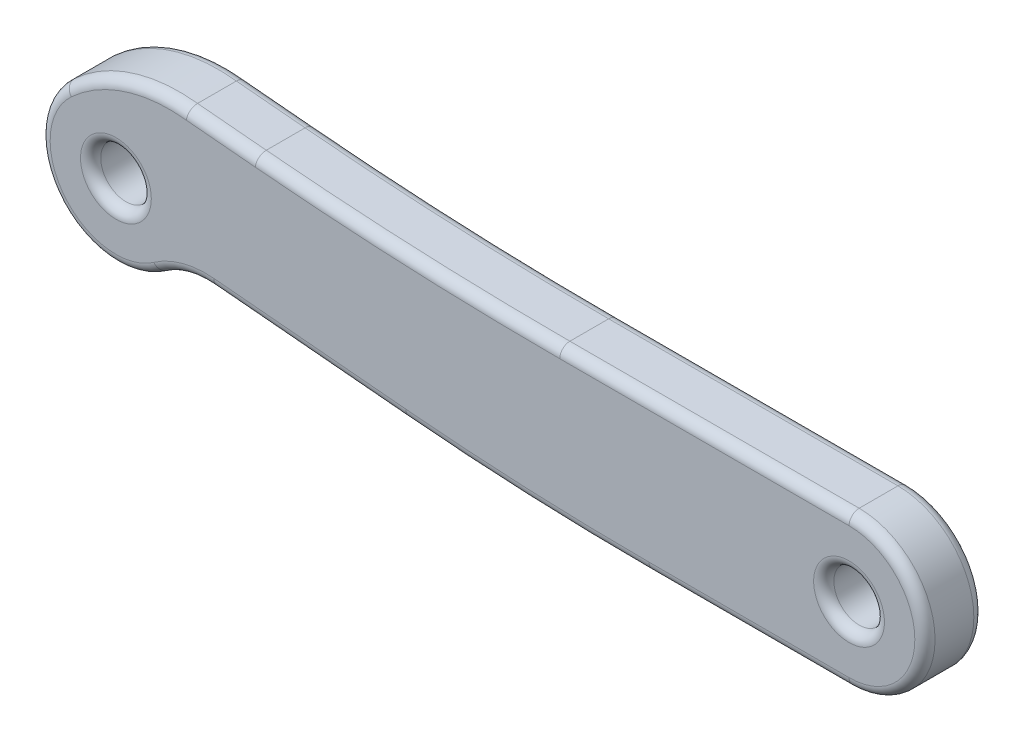
ISO-10303-21;
HEADER;
FILE_DESCRIPTION(('STEP AP214'),'2;1');
FILE_NAME('part.step','',(''),(''),'','','');
FILE_SCHEMA(('AUTOMOTIVE_DESIGN { 1 0 10303 214 1 1 1 1 }'));
ENDSEC;
DATA;
#1=APPLICATION_CONTEXT('core data for automotive mechanical design processes');
#2=APPLICATION_PROTOCOL_DEFINITION('international standard','automotive_design',2000,#1);
#3=PRODUCT_CONTEXT('',#1,'mechanical');
#4=PRODUCT('Part','Part','',(#3));
#5=PRODUCT_RELATED_PRODUCT_CATEGORY('part','',(#4));
#6=PRODUCT_DEFINITION_FORMATION('','',#4);
#7=PRODUCT_DEFINITION_CONTEXT('part definition',#1,'design');
#8=PRODUCT_DEFINITION('design','',#6,#7);
#9=PRODUCT_DEFINITION_SHAPE('','',#8);
#10=(LENGTH_UNIT() NAMED_UNIT(*) SI_UNIT(.MILLI.,.METRE.));
#11=(NAMED_UNIT(*) PLANE_ANGLE_UNIT() SI_UNIT($,.RADIAN.));
#12=(NAMED_UNIT(*) SI_UNIT($,.STERADIAN.) SOLID_ANGLE_UNIT());
#13=UNCERTAINTY_MEASURE_WITH_UNIT(LENGTH_MEASURE(1.E-05),#10,'distance_accuracy_value','');
#14=(GEOMETRIC_REPRESENTATION_CONTEXT(3) GLOBAL_UNCERTAINTY_ASSIGNED_CONTEXT((#13)) GLOBAL_UNIT_ASSIGNED_CONTEXT((#10,
#11,#12)) REPRESENTATION_CONTEXT('',''));
#15=CARTESIAN_POINT('',(0.,0.,0.));
#16=DIRECTION('',(0.,0.,1.));
#17=DIRECTION('',(1.,0.,0.));
#18=AXIS2_PLACEMENT_3D('',#15,#16,#17);
#19=CARTESIAN_POINT('',(0.,0.,1.75));
#20=DIRECTION('',(0.,0.,-1.));
#21=DIRECTION('',(-1.,0.,0.));
#22=AXIS2_PLACEMENT_3D('',#19,#20,#21);
#23=CYLINDRICAL_SURFACE('',#22,2.25);
#24=DIRECTION('',(0.,0.,1.));
#25=VECTOR('',#24,1.);
#26=CARTESIAN_POINT('',(-1.52467335470079,1.65465137157816,0.));
#27=LINE('',#26,#25);
#28=CARTESIAN_POINT('',(-1.52467335470079,1.65465137157816,0.3));
#29=VERTEX_POINT('',#28);
#30=CARTESIAN_POINT('',(-1.52467335470079,1.65465137157816,1.45));
#31=VERTEX_POINT('',#30);
#32=EDGE_CURVE('E458',#29,#31,#27,.T.);
#33=ORIENTED_EDGE('',*,*,#32,.F.);
#34=CARTESIAN_POINT('',(0.,0.,0.3));
#35=DIRECTION('',(0.,0.,1.));
#36=DIRECTION('',(1.,0.,0.));
#37=AXIS2_PLACEMENT_3D('',#34,#35,#36);
#38=CIRCLE('',#37,2.25);
#39=CARTESIAN_POINT('',(1.29610472523494,-1.83918801138537,0.3));
#40=VERTEX_POINT('',#39);
#41=EDGE_CURVE('E261',#29,#40,#38,.T.);
#42=ORIENTED_EDGE('',*,*,#41,.T.);
#43=DIRECTION('',(0.,0.,1.));
#44=VECTOR('',#43,1.);
#45=CARTESIAN_POINT('',(1.29610472523494,-1.83918801138537,0.));
#46=LINE('',#45,#44);
#47=CARTESIAN_POINT('',(1.29610472523494,-1.83918801138537,1.45));
#48=VERTEX_POINT('',#47);
#49=EDGE_CURVE('E405',#40,#48,#46,.T.);
#50=ORIENTED_EDGE('',*,*,#49,.T.);
#51=CARTESIAN_POINT('',(0.,0.,1.45));
#52=DIRECTION('',(0.,0.,1.));
#53=DIRECTION('',(1.,0.,0.));
#54=AXIS2_PLACEMENT_3D('',#51,#52,#53);
#55=CIRCLE('',#54,2.25);
#56=EDGE_CURVE('E259',#48,#31,#55,.F.);
#57=ORIENTED_EDGE('',*,*,#56,.T.);
#58=EDGE_LOOP('',(#33,#42,#50,#57));
#59=FACE_BOUND('',#58,.T.);
#60=ADVANCED_FACE('F34',(#59),#23,.T.);
#61=CARTESIAN_POINT('',(0.,2.25,1.75));
#62=DIRECTION('',(0.,-1.,0.));
#63=DIRECTION('',(0.,0.,-1.));
#64=AXIS2_PLACEMENT_3D('',#61,#62,#63);
#65=PLANE('',#64);
#66=DIRECTION('',(0.,0.,-1.));
#67=VECTOR('',#66,1.);
#68=CARTESIAN_POINT('',(21.74082228,2.25,1.75));
#69=LINE('',#68,#67);
#70=CARTESIAN_POINT('',(21.74082228,2.25,1.45));
#71=VERTEX_POINT('',#70);
#72=CARTESIAN_POINT('',(21.74082228,2.25,0.3));
#73=VERTEX_POINT('',#72);
#74=EDGE_CURVE('E403',#71,#73,#69,.T.);
#75=ORIENTED_EDGE('',*,*,#74,.T.);
#76=DIRECTION('',(-1.,0.,0.));
#77=VECTOR('',#76,1.);
#78=CARTESIAN_POINT('',(0.,2.25,0.3));
#79=LINE('',#78,#77);
#80=CARTESIAN_POINT('',(13.162158488708,2.25,0.3));
#81=VERTEX_POINT('',#80);
#82=EDGE_CURVE('E244',#73,#81,#79,.T.);
#83=ORIENTED_EDGE('',*,*,#82,.T.);
#84=DIRECTION('',(0.,0.,1.));
#85=VECTOR('',#84,1.);
#86=CARTESIAN_POINT('',(13.162158488708,2.25,0.));
#87=LINE('',#86,#85);
#88=CARTESIAN_POINT('',(13.162158488708,2.25,1.45));
#89=VERTEX_POINT('',#88);
#90=EDGE_CURVE('E475',#81,#89,#87,.T.);
#91=ORIENTED_EDGE('',*,*,#90,.T.);
#92=DIRECTION('',(-1.,0.,0.));
#93=VECTOR('',#92,1.);
#94=CARTESIAN_POINT('',(21.74082228,2.25,1.45));
#95=LINE('',#94,#93);
#96=EDGE_CURVE('E242',#89,#71,#95,.F.);
#97=ORIENTED_EDGE('',*,*,#96,.T.);
#98=EDGE_LOOP('',(#75,#83,#91,#97));
#99=FACE_BOUND('',#98,.T.);
#100=ADVANCED_FACE('F479',(#99),#65,.F.);
#101=CARTESIAN_POINT('',(0.,-2.25,1.75));
#102=DIRECTION('',(0.,1.,0.));
#103=DIRECTION('',(0.,0.,1.));
#104=AXIS2_PLACEMENT_3D('',#101,#102,#103);
#105=PLANE('',#104);
#106=DIRECTION('',(0.,0.,1.));
#107=VECTOR('',#106,1.);
#108=CARTESIAN_POINT('',(15.8071767602875,-2.25000000000006,0.));
#109=LINE('',#108,#107);
#110=CARTESIAN_POINT('',(15.8071767602875,-2.25000000000006,0.3));
#111=VERTEX_POINT('',#110);
#112=CARTESIAN_POINT('',(15.8071767602875,-2.25000000000006,1.45));
#113=VERTEX_POINT('',#112);
#114=EDGE_CURVE('E395',#111,#113,#109,.T.);
#115=ORIENTED_EDGE('',*,*,#114,.F.);
#116=DIRECTION('',(1.,0.,0.));
#117=VECTOR('',#116,1.);
#118=CARTESIAN_POINT('',(0.,-2.25,0.3));
#119=LINE('',#118,#117);
#120=CARTESIAN_POINT('',(21.74082228,-2.25,0.3));
#121=VERTEX_POINT('',#120);
#122=EDGE_CURVE('E236',#111,#121,#119,.T.);
#123=ORIENTED_EDGE('',*,*,#122,.T.);
#124=DIRECTION('',(0.,0.,-1.));
#125=VECTOR('',#124,1.);
#126=CARTESIAN_POINT('',(21.74082228,-2.25,1.75));
#127=LINE('',#126,#125);
#128=CARTESIAN_POINT('',(21.74082228,-2.25,1.45));
#129=VERTEX_POINT('',#128);
#130=EDGE_CURVE('E195',#129,#121,#127,.T.);
#131=ORIENTED_EDGE('',*,*,#130,.F.);
#132=DIRECTION('',(1.,0.,0.));
#133=VECTOR('',#132,1.);
#134=CARTESIAN_POINT('',(15.8071767602875,-2.25,1.45));
#135=LINE('',#134,#133);
#136=EDGE_CURVE('E234',#129,#113,#135,.F.);
#137=ORIENTED_EDGE('',*,*,#136,.T.);
#138=EDGE_LOOP('',(#115,#123,#131,#137));
#139=FACE_BOUND('',#138,.T.);
#140=ADVANCED_FACE('F495',(#139),#105,.F.);
#141=CARTESIAN_POINT('',(0.,0.,1.75));
#142=DIRECTION('',(0.,0.,1.));
#143=DIRECTION('',(1.,0.,0.));
#144=AXIS2_PLACEMENT_3D('',#141,#142,#143);
#145=PLANE('',#144);
#146=CARTESIAN_POINT('',(21.74082228,0.,1.75));
#147=DIRECTION('',(0.,0.,1.));
#148=DIRECTION('',(1.,0.,0.));
#149=AXIS2_PLACEMENT_3D('',#146,#147,#148);
#150=CIRCLE('',#149,1.05);
#151=CARTESIAN_POINT('',(22.79082228,0.,1.75));
#152=VERTEX_POINT('',#151);
#153=EDGE_CURVE('E12',#152,#152,#150,.F.);
#154=ORIENTED_EDGE('',*,*,#153,.T.);
#155=EDGE_LOOP('',(#154));
#156=FACE_BOUND('',#155,.T.);
#157=CARTESIAN_POINT('',(0.,0.,1.75));
#158=DIRECTION('',(0.,0.,1.));
#159=DIRECTION('',(1.,0.,0.));
#160=AXIS2_PLACEMENT_3D('',#157,#158,#159);
#161=CIRCLE('',#160,1.05);
#162=CARTESIAN_POINT('',(1.05,0.,1.75));
#163=VERTEX_POINT('',#162);
#164=EDGE_CURVE('E43',#163,#163,#161,.F.);
#165=ORIENTED_EDGE('',*,*,#164,.T.);
#166=EDGE_LOOP('',(#165));
#167=FACE_BOUND('',#166,.T.);
#168=CARTESIAN_POINT('',(13.162158488708,102.934591607014,1.75));
#169=DIRECTION('',(0.,0.,1.));
#170=DIRECTION('',(1.,0.,0.));
#171=AXIS2_PLACEMENT_3D('',#168,#169,#170);
#172=CIRCLE('',#171,100.984591607014);
#173=CARTESIAN_POINT('',(13.162158488708,1.95,1.75));
#174=VERTEX_POINT('',#173);
#175=CARTESIAN_POINT('',(4.1328255389998,2.35447981288885,1.75));
#176=VERTEX_POINT('',#175);
#177=EDGE_CURVE('E51',#174,#176,#172,.F.);
#178=ORIENTED_EDGE('',*,*,#177,.T.);
#179=DIRECTION('',(-0.995994638325983,0.0894129768316409,0.));
#180=VECTOR('',#179,1.);
#181=CARTESIAN_POINT('',(0.242718455459598,2.70370463915676,1.75));
#182=LINE('',#181,#180);
#183=CARTESIAN_POINT('',(2.09015922776099,2.53785517309011,1.75));
#184=VERTEX_POINT('',#183);
#185=EDGE_CURVE('E279',#176,#184,#182,.T.);
#186=ORIENTED_EDGE('',*,*,#185,.T.);
#187=CARTESIAN_POINT('',(1.58269722959737,-1.71762176709653,1.75));
#188=DIRECTION('',(0.,0.,1.));
#189=DIRECTION('',(1.,0.,0.));
#190=AXIS2_PLACEMENT_3D('',#187,#188,#189);
#191=CIRCLE('',#190,4.28562733657985);
#192=CARTESIAN_POINT('',(-1.32138357407402,1.43403118870108,1.75));
#193=VERTEX_POINT('',#192);
#194=EDGE_CURVE('E263',#184,#193,#191,.T.);
#195=ORIENTED_EDGE('',*,*,#194,.T.);
#196=CARTESIAN_POINT('',(0.,0.,1.75));
#197=DIRECTION('',(0.,0.,1.));
#198=DIRECTION('',(1.,0.,0.));
#199=AXIS2_PLACEMENT_3D('',#196,#197,#198);
#200=CIRCLE('',#199,1.95);
#201=CARTESIAN_POINT('',(1.12329076187028,-1.59396294320065,1.75));
#202=VERTEX_POINT('',#201);
#203=EDGE_CURVE('E265',#193,#202,#200,.T.);
#204=ORIENTED_EDGE('',*,*,#203,.T.);
#205=CARTESIAN_POINT('',(2.66557638606268,-3.78248457646024,1.75));
#206=DIRECTION('',(0.,0.,1.));
#207=DIRECTION('',(1.,0.,0.));
#208=AXIS2_PLACEMENT_3D('',#205,#206,#207);
#209=CIRCLE('',#208,2.67736286032277);
#210=CARTESIAN_POINT('',(2.90496736946259,-1.11584552272564,1.75));
#211=VERTEX_POINT('',#210);
#212=EDGE_CURVE('E267',#202,#211,#209,.F.);
#213=ORIENTED_EDGE('',*,*,#212,.T.);
#214=DIRECTION('',(0.995994638325983,-0.0894129768316325,0.));
#215=VECTOR('',#214,1.);
#216=CARTESIAN_POINT('',(-0.0761471648852078,-0.848223274035544,1.75));
#217=LINE('',#216,#215);
#218=CARTESIAN_POINT('',(8.60095043109571,-1.62718843756218,1.75));
#219=VERTEX_POINT('',#218);
#220=EDGE_CURVE('E269',#211,#219,#217,.T.);
#221=ORIENTED_EDGE('',*,*,#220,.T.);
#222=CARTESIAN_POINT('',(15.8071767602885,78.6448597680787,1.75));
#223=DIRECTION('',(0.,0.,1.));
#224=DIRECTION('',(1.,0.,0.));
#225=AXIS2_PLACEMENT_3D('',#222,#223,#224);
#226=CIRCLE('',#225,80.5948597680787);
#227=CARTESIAN_POINT('',(15.8071767602875,-1.95000000000006,1.75));
#228=VERTEX_POINT('',#227);
#229=EDGE_CURVE('E271',#219,#228,#226,.T.);
#230=ORIENTED_EDGE('',*,*,#229,.T.);
#231=DIRECTION('',(1.,0.,0.));
#232=VECTOR('',#231,1.);
#233=CARTESIAN_POINT('',(21.74082228,-1.95,1.75));
#234=LINE('',#233,#232);
#235=CARTESIAN_POINT('',(21.74082228,-1.95,1.75));
#236=VERTEX_POINT('',#235);
#237=EDGE_CURVE('E273',#228,#236,#234,.T.);
#238=ORIENTED_EDGE('',*,*,#237,.T.);
#239=CARTESIAN_POINT('',(21.74082228,0.,1.75));
#240=DIRECTION('',(0.,0.,1.));
#241=DIRECTION('',(1.,0.,0.));
#242=AXIS2_PLACEMENT_3D('',#239,#240,#241);
#243=CIRCLE('',#242,1.95);
#244=CARTESIAN_POINT('',(21.74082228,1.95,1.75));
#245=VERTEX_POINT('',#244);
#246=EDGE_CURVE('E275',#236,#245,#243,.T.);
#247=ORIENTED_EDGE('',*,*,#246,.T.);
#248=DIRECTION('',(-1.,0.,0.));
#249=VECTOR('',#248,1.);
#250=CARTESIAN_POINT('',(13.162158488708,1.95,1.75));
#251=LINE('',#250,#249);
#252=EDGE_CURVE('E56',#245,#174,#251,.T.);
#253=ORIENTED_EDGE('',*,*,#252,.T.);
#254=EDGE_LOOP('',(#178,#186,#195,#204,#213,#221,#230,#238,#247,#253));
#255=FACE_BOUND('',#254,.T.);
#256=ADVANCED_FACE('F719',(#156,#167,#255),#145,.T.);
#257=CARTESIAN_POINT('',(0.,0.,0.));
#258=DIRECTION('',(0.,0.,1.));
#259=DIRECTION('',(1.,0.,0.));
#260=AXIS2_PLACEMENT_3D('',#257,#258,#259);
#261=PLANE('',#260);
#262=CARTESIAN_POINT('',(21.74082228,0.,0.));
#263=DIRECTION('',(0.,0.,1.));
#264=DIRECTION('',(1.,0.,0.));
#265=AXIS2_PLACEMENT_3D('',#262,#263,#264);
#266=CIRCLE('',#265,1.05);
#267=CARTESIAN_POINT('',(22.79082228,0.,0.));
#268=VERTEX_POINT('',#267);
#269=EDGE_CURVE('E203',#268,#268,#266,.T.);
#270=ORIENTED_EDGE('',*,*,#269,.T.);
#271=EDGE_LOOP('',(#270));
#272=FACE_BOUND('',#271,.T.);
#273=CARTESIAN_POINT('',(0.,0.,0.));
#274=DIRECTION('',(0.,0.,1.));
#275=DIRECTION('',(1.,0.,0.));
#276=AXIS2_PLACEMENT_3D('',#273,#274,#275);
#277=CIRCLE('',#276,1.05);
#278=CARTESIAN_POINT('',(1.05,0.,0.));
#279=VERTEX_POINT('',#278);
#280=EDGE_CURVE('E200',#279,#279,#277,.T.);
#281=ORIENTED_EDGE('',*,*,#280,.T.);
#282=EDGE_LOOP('',(#281));
#283=FACE_BOUND('',#282,.T.);
#284=DIRECTION('',(0.995994638325983,-0.0894129768316325,0.));
#285=VECTOR('',#284,1.);
#286=CARTESIAN_POINT('',(2.90496736946259,-1.11584552272564,0.));
#287=LINE('',#286,#285);
#288=CARTESIAN_POINT('',(8.60095043109571,-1.62718843756216,0.));
#289=VERTEX_POINT('',#288);
#290=CARTESIAN_POINT('',(2.90496736946259,-1.11584552272564,0.));
#291=VERTEX_POINT('',#290);
#292=EDGE_CURVE('E199',#289,#291,#287,.F.);
#293=ORIENTED_EDGE('',*,*,#292,.T.);
#294=CARTESIAN_POINT('',(2.66557638606268,-3.78248457646024,0.));
#295=DIRECTION('',(0.,0.,1.));
#296=DIRECTION('',(1.,0.,0.));
#297=AXIS2_PLACEMENT_3D('',#294,#295,#296);
#298=CIRCLE('',#297,2.67736286032277);
#299=CARTESIAN_POINT('',(1.12329076187028,-1.59396294320065,0.));
#300=VERTEX_POINT('',#299);
#301=EDGE_CURVE('E178',#291,#300,#298,.T.);
#302=ORIENTED_EDGE('',*,*,#301,.T.);
#303=CARTESIAN_POINT('',(0.,0.,0.));
#304=DIRECTION('',(0.,0.,1.));
#305=DIRECTION('',(1.,0.,0.));
#306=AXIS2_PLACEMENT_3D('',#303,#304,#305);
#307=CIRCLE('',#306,1.95);
#308=CARTESIAN_POINT('',(-1.32138357407401,1.43403118870107,0.));
#309=VERTEX_POINT('',#308);
#310=EDGE_CURVE('E188',#300,#309,#307,.F.);
#311=ORIENTED_EDGE('',*,*,#310,.T.);
#312=CARTESIAN_POINT('',(1.58269722959737,-1.71762176709653,0.));
#313=DIRECTION('',(0.,0.,1.));
#314=DIRECTION('',(1.,0.,0.));
#315=AXIS2_PLACEMENT_3D('',#312,#313,#314);
#316=CIRCLE('',#315,4.28562733657985);
#317=CARTESIAN_POINT('',(2.090159227761,2.53785517309011,0.));
#318=VERTEX_POINT('',#317);
#319=EDGE_CURVE('E194',#309,#318,#316,.F.);
#320=ORIENTED_EDGE('',*,*,#319,.T.);
#321=DIRECTION('',(-0.995994638325983,0.0894129768316409,0.));
#322=VECTOR('',#321,1.);
#323=CARTESIAN_POINT('',(4.13282553899979,2.35447981288883,0.));
#324=LINE('',#323,#322);
#325=CARTESIAN_POINT('',(4.1328255389998,2.35447981288883,0.));
#326=VERTEX_POINT('',#325);
#327=EDGE_CURVE('E417',#318,#326,#324,.F.);
#328=ORIENTED_EDGE('',*,*,#327,.T.);
#329=CARTESIAN_POINT('',(13.162158488708,102.934591607014,0.));
#330=DIRECTION('',(0.,0.,1.));
#331=DIRECTION('',(1.,0.,0.));
#332=AXIS2_PLACEMENT_3D('',#329,#330,#331);
#333=CIRCLE('',#332,100.984591607014);
#334=CARTESIAN_POINT('',(13.162158488708,1.95,0.));
#335=VERTEX_POINT('',#334);
#336=EDGE_CURVE('E419',#326,#335,#333,.T.);
#337=ORIENTED_EDGE('',*,*,#336,.T.);
#338=DIRECTION('',(-1.,0.,0.));
#339=VECTOR('',#338,1.);
#340=CARTESIAN_POINT('',(0.,1.95,0.));
#341=LINE('',#340,#339);
#342=CARTESIAN_POINT('',(21.74082228,1.95,0.));
#343=VERTEX_POINT('',#342);
#344=EDGE_CURVE('E421',#335,#343,#341,.F.);
#345=ORIENTED_EDGE('',*,*,#344,.T.);
#346=CARTESIAN_POINT('',(21.74082228,0.,0.));
#347=DIRECTION('',(0.,0.,1.));
#348=DIRECTION('',(1.,0.,0.));
#349=AXIS2_PLACEMENT_3D('',#346,#347,#348);
#350=CIRCLE('',#349,1.95);
#351=CARTESIAN_POINT('',(21.74082228,-1.95,0.));
#352=VERTEX_POINT('',#351);
#353=EDGE_CURVE('E423',#343,#352,#350,.F.);
#354=ORIENTED_EDGE('',*,*,#353,.T.);
#355=DIRECTION('',(1.,0.,0.));
#356=VECTOR('',#355,1.);
#357=CARTESIAN_POINT('',(0.,-1.95,0.));
#358=LINE('',#357,#356);
#359=CARTESIAN_POINT('',(15.8071767602875,-1.95,0.));
#360=VERTEX_POINT('',#359);
#361=EDGE_CURVE('E425',#352,#360,#358,.F.);
#362=ORIENTED_EDGE('',*,*,#361,.T.);
#363=CARTESIAN_POINT('',(15.8071767602885,78.6448597680787,0.));
#364=DIRECTION('',(0.,0.,1.));
#365=DIRECTION('',(1.,0.,0.));
#366=AXIS2_PLACEMENT_3D('',#363,#364,#365);
#367=CIRCLE('',#366,80.5948597680787);
#368=EDGE_CURVE('E205',#360,#289,#367,.F.);
#369=ORIENTED_EDGE('',*,*,#368,.T.);
#370=EDGE_LOOP('',(#293,#302,#311,#320,#328,#337,#345,#354,#362,#369));
#371=FACE_BOUND('',#370,.T.);
#372=ADVANCED_FACE('F197',(#272,#283,#371),#261,.F.);
#373=CARTESIAN_POINT('',(21.74082228,0.,1.75));
#374=DIRECTION('',(0.,0.,-1.));
#375=DIRECTION('',(-1.,0.,0.));
#376=AXIS2_PLACEMENT_3D('',#373,#374,#375);
#377=CYLINDRICAL_SURFACE('',#376,2.25);
#378=ORIENTED_EDGE('',*,*,#130,.T.);
#379=CARTESIAN_POINT('',(21.74082228,0.,0.3));
#380=DIRECTION('',(0.,0.,1.));
#381=DIRECTION('',(1.,0.,0.));
#382=AXIS2_PLACEMENT_3D('',#379,#380,#381);
#383=CIRCLE('',#382,2.25);
#384=EDGE_CURVE('E240',#121,#73,#383,.T.);
#385=ORIENTED_EDGE('',*,*,#384,.T.);
#386=ORIENTED_EDGE('',*,*,#74,.F.);
#387=CARTESIAN_POINT('',(21.74082228,0.,1.45));
#388=DIRECTION('',(0.,0.,1.));
#389=DIRECTION('',(1.,0.,0.));
#390=AXIS2_PLACEMENT_3D('',#387,#388,#389);
#391=CIRCLE('',#390,2.25);
#392=EDGE_CURVE('E238',#71,#129,#391,.F.);
#393=ORIENTED_EDGE('',*,*,#392,.T.);
#394=EDGE_LOOP('',(#378,#385,#386,#393));
#395=FACE_BOUND('',#394,.T.);
#396=ADVANCED_FACE('F492',(#395),#377,.T.);
#397=CARTESIAN_POINT('',(0.,0.,1.75));
#398=DIRECTION('',(0.,0.,-1.));
#399=DIRECTION('',(-1.,0.,0.));
#400=AXIS2_PLACEMENT_3D('',#397,#398,#399);
#401=CYLINDRICAL_SURFACE('',#400,0.75);
#402=CARTESIAN_POINT('',(0.,0.,0.3));
#403=DIRECTION('',(0.,0.,1.));
#404=DIRECTION('',(1.,0.,0.));
#405=AXIS2_PLACEMENT_3D('',#402,#403,#404);
#406=CIRCLE('',#405,0.75);
#407=CARTESIAN_POINT('',(0.75,0.,0.3));
#408=VERTEX_POINT('',#407);
#409=EDGE_CURVE('E220',#408,#408,#406,.F.);
#410=ORIENTED_EDGE('',*,*,#409,.T.);
#411=EDGE_LOOP('',(#410));
#412=FACE_BOUND('',#411,.T.);
#413=CARTESIAN_POINT('',(0.,0.,1.45));
#414=DIRECTION('',(0.,0.,1.));
#415=DIRECTION('',(1.,0.,0.));
#416=AXIS2_PLACEMENT_3D('',#413,#414,#415);
#417=CIRCLE('',#416,0.75);
#418=CARTESIAN_POINT('',(0.75,0.,1.45));
#419=VERTEX_POINT('',#418);
#420=EDGE_CURVE('E217',#419,#419,#417,.T.);
#421=ORIENTED_EDGE('',*,*,#420,.T.);
#422=EDGE_LOOP('',(#421));
#423=FACE_BOUND('',#422,.T.);
#424=ADVANCED_FACE('F765',(#412,#423),#401,.F.);
#425=CARTESIAN_POINT('',(21.74082228,0.,1.75));
#426=DIRECTION('',(0.,0.,-1.));
#427=DIRECTION('',(-1.,0.,0.));
#428=AXIS2_PLACEMENT_3D('',#425,#426,#427);
#429=CYLINDRICAL_SURFACE('',#428,0.750000000000002);
#430=CARTESIAN_POINT('',(21.74082228,0.,0.3));
#431=DIRECTION('',(0.,0.,1.));
#432=DIRECTION('',(1.,0.,0.));
#433=AXIS2_PLACEMENT_3D('',#430,#431,#432);
#434=CIRCLE('',#433,0.750000000000002);
#435=CARTESIAN_POINT('',(22.49082228,0.,0.3));
#436=VERTEX_POINT('',#435);
#437=EDGE_CURVE('E214',#436,#436,#434,.F.);
#438=ORIENTED_EDGE('',*,*,#437,.T.);
#439=EDGE_LOOP('',(#438));
#440=FACE_BOUND('',#439,.T.);
#441=CARTESIAN_POINT('',(21.74082228,0.,1.45));
#442=DIRECTION('',(0.,0.,1.));
#443=DIRECTION('',(1.,0.,0.));
#444=AXIS2_PLACEMENT_3D('',#441,#442,#443);
#445=CIRCLE('',#444,0.750000000000002);
#446=CARTESIAN_POINT('',(22.49082228,0.,1.45));
#447=VERTEX_POINT('',#446);
#448=EDGE_CURVE('E211',#447,#447,#445,.T.);
#449=ORIENTED_EDGE('',*,*,#448,.T.);
#450=EDGE_LOOP('',(#449));
#451=FACE_BOUND('',#450,.T.);
#452=ADVANCED_FACE('F770',(#440,#451),#429,.F.);
#453=CARTESIAN_POINT('',(15.8071767602885,78.6448597680787,0.));
#454=DIRECTION('',(0.,0.,1.));
#455=DIRECTION('',(1.,0.,0.));
#456=AXIS2_PLACEMENT_3D('',#453,#454,#455);
#457=CYLINDRICAL_SURFACE('',#456,80.8948597680787);
#458=DIRECTION('',(0.,0.,1.));
#459=VECTOR('',#458,1.);
#460=CARTESIAN_POINT('',(8.57412653804622,-1.92598682905998,0.));
#461=LINE('',#460,#459);
#462=CARTESIAN_POINT('',(8.57412653804622,-1.92598682905998,0.3));
#463=VERTEX_POINT('',#462);
#464=CARTESIAN_POINT('',(8.57412653804622,-1.92598682905998,1.45));
#465=VERTEX_POINT('',#464);
#466=EDGE_CURVE('E392',#463,#465,#461,.T.);
#467=ORIENTED_EDGE('',*,*,#466,.F.);
#468=CARTESIAN_POINT('',(15.8071767602885,78.6448597680787,0.3));
#469=DIRECTION('',(0.,0.,1.));
#470=DIRECTION('',(1.,0.,0.));
#471=AXIS2_PLACEMENT_3D('',#468,#469,#470);
#472=CIRCLE('',#471,80.8948597680787);
#473=EDGE_CURVE('E232',#463,#111,#472,.T.);
#474=ORIENTED_EDGE('',*,*,#473,.T.);
#475=ORIENTED_EDGE('',*,*,#114,.T.);
#476=CARTESIAN_POINT('',(15.8071767602885,78.6448597680787,1.45));
#477=DIRECTION('',(0.,0.,1.));
#478=DIRECTION('',(1.,0.,0.));
#479=AXIS2_PLACEMENT_3D('',#476,#477,#478);
#480=CIRCLE('',#479,80.8948597680787);
#481=EDGE_CURVE('E230',#113,#465,#480,.F.);
#482=ORIENTED_EDGE('',*,*,#481,.T.);
#483=EDGE_LOOP('',(#467,#474,#475,#482));
#484=FACE_BOUND('',#483,.T.);
#485=ADVANCED_FACE('F391',(#484),#457,.T.);
#486=CARTESIAN_POINT('',(2.8781434764131,-1.41464391422344,0.));
#487=DIRECTION('',(-0.0894129768316325,-0.995994638325983,0.));
#488=DIRECTION('',(0.995994638325983,-0.0894129768316325,0.));
#489=AXIS2_PLACEMENT_3D('',#486,#487,#488);
#490=PLANE('',#489);
#491=DIRECTION('',(0.,0.,1.));
#492=VECTOR('',#491,1.);
#493=CARTESIAN_POINT('',(2.8781434764131,-1.41464391422344,0.));
#494=LINE('',#493,#492);
#495=CARTESIAN_POINT('',(2.8781434764131,-1.41464391422344,0.3));
#496=VERTEX_POINT('',#495);
#497=CARTESIAN_POINT('',(2.8781434764131,-1.41464391422344,1.45));
#498=VERTEX_POINT('',#497);
#499=EDGE_CURVE('E401',#496,#498,#494,.T.);
#500=ORIENTED_EDGE('',*,*,#499,.F.);
#501=DIRECTION('',(0.995994638325983,-0.0894129768316325,0.));
#502=VECTOR('',#501,1.);
#503=CARTESIAN_POINT('',(8.57412653804622,-1.92598682905998,0.3));
#504=LINE('',#503,#502);
#505=EDGE_CURVE('E228',#496,#463,#504,.T.);
#506=ORIENTED_EDGE('',*,*,#505,.T.);
#507=ORIENTED_EDGE('',*,*,#466,.T.);
#508=DIRECTION('',(0.995994638325983,-0.0894129768316325,0.));
#509=VECTOR('',#508,1.);
#510=CARTESIAN_POINT('',(2.8781434764131,-1.41464391422344,1.45));
#511=LINE('',#510,#509);
#512=EDGE_CURVE('E226',#465,#498,#511,.F.);
#513=ORIENTED_EDGE('',*,*,#512,.T.);
#514=EDGE_LOOP('',(#500,#506,#507,#513));
#515=FACE_BOUND('',#514,.T.);
#516=ADVANCED_FACE('F398',(#515),#490,.T.);
#517=CARTESIAN_POINT('',(2.66557638606268,-3.78248457646024,0.));
#518=DIRECTION('',(0.,0.,1.));
#519=DIRECTION('',(1.,0.,0.));
#520=AXIS2_PLACEMENT_3D('',#517,#518,#519);
#521=CYLINDRICAL_SURFACE('',#520,2.37736286032277);
#522=ORIENTED_EDGE('',*,*,#49,.F.);
#523=CARTESIAN_POINT('',(2.66557638606268,-3.78248457646024,0.3));
#524=DIRECTION('',(0.,0.,1.));
#525=DIRECTION('',(1.,0.,0.));
#526=AXIS2_PLACEMENT_3D('',#523,#524,#525);
#527=CIRCLE('',#526,2.37736286032277);
#528=EDGE_CURVE('E181',#40,#496,#527,.F.);
#529=ORIENTED_EDGE('',*,*,#528,.T.);
#530=ORIENTED_EDGE('',*,*,#499,.T.);
#531=CARTESIAN_POINT('',(2.66557638606268,-3.78248457646024,1.45));
#532=DIRECTION('',(0.,0.,1.));
#533=DIRECTION('',(1.,0.,0.));
#534=AXIS2_PLACEMENT_3D('',#531,#532,#533);
#535=CIRCLE('',#534,2.37736286032277);
#536=EDGE_CURVE('E223',#498,#48,#535,.T.);
#537=ORIENTED_EDGE('',*,*,#536,.T.);
#538=EDGE_LOOP('',(#522,#529,#530,#537));
#539=FACE_BOUND('',#538,.T.);
#540=ADVANCED_FACE('F435',(#539),#521,.F.);
#541=CARTESIAN_POINT('',(1.58269722959737,-1.71762176709653,0.));
#542=DIRECTION('',(0.,0.,1.));
#543=DIRECTION('',(1.,0.,0.));
#544=AXIS2_PLACEMENT_3D('',#541,#542,#543);
#545=CYLINDRICAL_SURFACE('',#544,4.58562733657985);
#546=DIRECTION('',(0.,0.,1.));
#547=VECTOR('',#546,1.);
#548=CARTESIAN_POINT('',(2.1212656371183,2.83626911218558,0.));
#549=LINE('',#548,#547);
#550=CARTESIAN_POINT('',(2.1212656371183,2.83626911218558,0.3));
#551=VERTEX_POINT('',#550);
#552=CARTESIAN_POINT('',(2.1212656371183,2.83626911218558,1.45));
#553=VERTEX_POINT('',#552);
#554=EDGE_CURVE('E411',#551,#553,#549,.T.);
#555=ORIENTED_EDGE('',*,*,#554,.F.);
#556=CARTESIAN_POINT('',(1.58269722959737,-1.71762176709653,0.3));
#557=DIRECTION('',(0.,0.,1.));
#558=DIRECTION('',(1.,0.,0.));
#559=AXIS2_PLACEMENT_3D('',#556,#557,#558);
#560=CIRCLE('',#559,4.58562733657985);
#561=EDGE_CURVE('E257',#551,#29,#560,.T.);
#562=ORIENTED_EDGE('',*,*,#561,.T.);
#563=ORIENTED_EDGE('',*,*,#32,.T.);
#564=CARTESIAN_POINT('',(1.58269722959737,-1.71762176709653,1.45));
#565=DIRECTION('',(0.,0.,1.));
#566=DIRECTION('',(1.,0.,0.));
#567=AXIS2_PLACEMENT_3D('',#564,#565,#566);
#568=CIRCLE('',#567,4.58562733657985);
#569=EDGE_CURVE('E255',#31,#553,#568,.F.);
#570=ORIENTED_EDGE('',*,*,#569,.T.);
#571=EDGE_LOOP('',(#555,#562,#563,#570));
#572=FACE_BOUND('',#571,.T.);
#573=ADVANCED_FACE('F456',(#572),#545,.T.);
#574=CARTESIAN_POINT('',(2.1212656371183,2.83626911218558,0.));
#575=DIRECTION('',(0.0894129768316409,0.995994638325982,0.));
#576=DIRECTION('',(-0.995994638325983,0.0894129768316409,0.));
#577=AXIS2_PLACEMENT_3D('',#574,#575,#576);
#578=PLANE('',#577);
#579=DIRECTION('',(0.,0.,1.));
#580=VECTOR('',#579,1.);
#581=CARTESIAN_POINT('',(4.15964943204929,2.65327820438663,0.));
#582=LINE('',#581,#580);
#583=CARTESIAN_POINT('',(4.15964943204929,2.65327820438663,0.3));
#584=VERTEX_POINT('',#583);
#585=CARTESIAN_POINT('',(4.15964943204929,2.65327820438663,1.45));
#586=VERTEX_POINT('',#585);
#587=EDGE_CURVE('E465',#584,#586,#582,.T.);
#588=ORIENTED_EDGE('',*,*,#587,.F.);
#589=DIRECTION('',(-0.995994638325983,0.0894129768316409,0.));
#590=VECTOR('',#589,1.);
#591=CARTESIAN_POINT('',(2.1212656371183,2.83626911218558,0.3));
#592=LINE('',#591,#590);
#593=EDGE_CURVE('E253',#584,#551,#592,.T.);
#594=ORIENTED_EDGE('',*,*,#593,.T.);
#595=ORIENTED_EDGE('',*,*,#554,.T.);
#596=DIRECTION('',(-0.995994638325983,0.0894129768316409,0.));
#597=VECTOR('',#596,1.);
#598=CARTESIAN_POINT('',(2.1212656371183,2.83626911218558,1.45));
#599=LINE('',#598,#597);
#600=EDGE_CURVE('E250',#553,#586,#599,.F.);
#601=ORIENTED_EDGE('',*,*,#600,.T.);
#602=EDGE_LOOP('',(#588,#594,#595,#601));
#603=FACE_BOUND('',#602,.T.);
#604=ADVANCED_FACE('F462',(#603),#578,.T.);
#605=CARTESIAN_POINT('',(13.162158488708,102.934591607014,0.));
#606=DIRECTION('',(0.,0.,1.));
#607=DIRECTION('',(1.,0.,0.));
#608=AXIS2_PLACEMENT_3D('',#605,#606,#607);
#609=CYLINDRICAL_SURFACE('',#608,100.684591607014);
#610=ORIENTED_EDGE('',*,*,#90,.F.);
#611=CARTESIAN_POINT('',(13.162158488708,102.934591607014,0.3));
#612=DIRECTION('',(0.,0.,1.));
#613=DIRECTION('',(1.,0.,0.));
#614=AXIS2_PLACEMENT_3D('',#611,#612,#613);
#615=CIRCLE('',#614,100.684591607014);
#616=EDGE_CURVE('E248',#81,#584,#615,.F.);
#617=ORIENTED_EDGE('',*,*,#616,.T.);
#618=ORIENTED_EDGE('',*,*,#587,.T.);
#619=CARTESIAN_POINT('',(13.162158488708,102.934591607014,1.45));
#620=DIRECTION('',(0.,0.,1.));
#621=DIRECTION('',(1.,0.,0.));
#622=AXIS2_PLACEMENT_3D('',#619,#620,#621);
#623=CIRCLE('',#622,100.684591607014);
#624=EDGE_CURVE('E246',#586,#89,#623,.T.);
#625=ORIENTED_EDGE('',*,*,#624,.T.);
#626=EDGE_LOOP('',(#610,#617,#618,#625));
#627=FACE_BOUND('',#626,.T.);
#628=ADVANCED_FACE('F474',(#627),#609,.F.);
#629=CARTESIAN_POINT('',(21.74082228,0.,0.3));
#630=DIRECTION('',(0.,0.,1.));
#631=DIRECTION('',(1.,0.,0.));
#632=AXIS2_PLACEMENT_3D('',#629,#630,#631);
#633=TOROIDAL_SURFACE('',#632,1.05,0.3);
#634=ORIENTED_EDGE('',*,*,#437,.F.);
#635=EDGE_LOOP('',(#634));
#636=FACE_BOUND('',#635,.T.);
#637=ORIENTED_EDGE('',*,*,#269,.F.);
#638=EDGE_LOOP('',(#637));
#639=FACE_BOUND('',#638,.T.);
#640=ADVANCED_FACE('F526',(#636,#639),#633,.T.);
#641=CARTESIAN_POINT('',(0.,0.,0.3));
#642=DIRECTION('',(0.,0.,1.));
#643=DIRECTION('',(1.,0.,0.));
#644=AXIS2_PLACEMENT_3D('',#641,#642,#643);
#645=TOROIDAL_SURFACE('',#644,1.05,0.3);
#646=ORIENTED_EDGE('',*,*,#409,.F.);
#647=EDGE_LOOP('',(#646));
#648=FACE_BOUND('',#647,.T.);
#649=ORIENTED_EDGE('',*,*,#280,.F.);
#650=EDGE_LOOP('',(#649));
#651=FACE_BOUND('',#650,.T.);
#652=ADVANCED_FACE('F324',(#648,#651),#645,.T.);
#653=CARTESIAN_POINT('',(0.,1.95,0.3));
#654=DIRECTION('',(-1.,0.,0.));
#655=DIRECTION('',(0.,0.,1.));
#656=AXIS2_PLACEMENT_3D('',#653,#654,#655);
#657=CYLINDRICAL_SURFACE('',#656,0.3);
#658=CARTESIAN_POINT('',(21.74082228,1.95,0.3));
#659=DIRECTION('',(1.,0.,0.));
#660=DIRECTION('',(0.,0.,-1.));
#661=AXIS2_PLACEMENT_3D('',#658,#659,#660);
#662=CIRCLE('',#661,0.3);
#663=EDGE_CURVE('E502',#343,#73,#662,.T.);
#664=ORIENTED_EDGE('',*,*,#663,.F.);
#665=ORIENTED_EDGE('',*,*,#344,.F.);
#666=CARTESIAN_POINT('',(13.162158488708,1.95,0.3));
#667=DIRECTION('',(-1.,0.,0.));
#668=DIRECTION('',(0.,0.,1.));
#669=AXIS2_PLACEMENT_3D('',#666,#667,#668);
#670=CIRCLE('',#669,0.3);
#671=EDGE_CURVE('E351',#81,#335,#670,.T.);
#672=ORIENTED_EDGE('',*,*,#671,.F.);
#673=ORIENTED_EDGE('',*,*,#82,.F.);
#674=EDGE_LOOP('',(#664,#665,#672,#673));
#675=FACE_BOUND('',#674,.T.);
#676=ADVANCED_FACE('F320',(#675),#657,.T.);
#677=CARTESIAN_POINT('',(13.162158488708,102.934591607014,0.3));
#678=DIRECTION('',(0.,0.,1.));
#679=DIRECTION('',(1.,0.,0.));
#680=AXIS2_PLACEMENT_3D('',#677,#678,#679);
#681=TOROIDAL_SURFACE('',#680,100.984591607014,0.3);
#682=ORIENTED_EDGE('',*,*,#671,.T.);
#683=ORIENTED_EDGE('',*,*,#336,.F.);
#684=CARTESIAN_POINT('',(4.1328255389998,2.35447981288883,0.3));
#685=DIRECTION('',(-0.995994638325985,0.0894129768316155,0.));
#686=DIRECTION('',(-0.0894129768316155,-0.995994638325985,0.));
#687=AXIS2_PLACEMENT_3D('',#684,#685,#686);
#688=CIRCLE('',#687,0.3);
#689=EDGE_CURVE('E500',#584,#326,#688,.T.);
#690=ORIENTED_EDGE('',*,*,#689,.F.);
#691=ORIENTED_EDGE('',*,*,#616,.F.);
#692=EDGE_LOOP('',(#682,#683,#690,#691));
#693=FACE_BOUND('',#692,.T.);
#694=ADVANCED_FACE('F316',(#693),#681,.T.);
#695=CARTESIAN_POINT('',(21.74082228,0.,0.3));
#696=DIRECTION('',(0.,0.,1.));
#697=DIRECTION('',(1.,0.,0.));
#698=AXIS2_PLACEMENT_3D('',#695,#696,#697);
#699=TOROIDAL_SURFACE('',#698,1.95,0.3);
#700=ORIENTED_EDGE('',*,*,#663,.T.);
#701=ORIENTED_EDGE('',*,*,#384,.F.);
#702=CARTESIAN_POINT('',(21.74082228,-1.95,0.3));
#703=DIRECTION('',(-1.,0.,0.));
#704=DIRECTION('',(0.,0.,1.));
#705=AXIS2_PLACEMENT_3D('',#702,#703,#704);
#706=CIRCLE('',#705,0.3);
#707=EDGE_CURVE('E298',#352,#121,#706,.T.);
#708=ORIENTED_EDGE('',*,*,#707,.F.);
#709=ORIENTED_EDGE('',*,*,#353,.F.);
#710=EDGE_LOOP('',(#700,#701,#708,#709));
#711=FACE_BOUND('',#710,.T.);
#712=ADVANCED_FACE('F313',(#711),#699,.T.);
#713=CARTESIAN_POINT('',(2.09444174406881,2.53747072068778,0.3));
#714=DIRECTION('',(0.995994638325983,-0.0894129768316409,0.));
#715=DIRECTION('',(0.0894129768316409,0.995994638325983,0.));
#716=AXIS2_PLACEMENT_3D('',#713,#714,#715);
#717=CYLINDRICAL_SURFACE('',#716,0.3);
#718=ORIENTED_EDGE('',*,*,#689,.T.);
#719=ORIENTED_EDGE('',*,*,#327,.F.);
#720=CARTESIAN_POINT('',(2.1212656371183,2.83626911218558,0.3));
#721=CARTESIAN_POINT('',(2.12126710195287,2.83628337934528,0.283124440537859));
#722=CARTESIAN_POINT('',(2.1211184200928,2.83485354220135,0.266253169150532));
#723=CARTESIAN_POINT('',(2.12053154773279,2.8292107022637,0.232999427126597));
#724=CARTESIAN_POINT('',(2.1200935611735,2.82499966003562,0.216616620651045));
#725=CARTESIAN_POINT('',(2.11893855650489,2.81389649173755,0.184787236715818));
#726=CARTESIAN_POINT('',(2.11822140327523,2.80700306735997,0.169341116815403));
#727=CARTESIAN_POINT('',(2.11652887849002,2.79073769168995,0.139835502839893));
#728=CARTESIAN_POINT('',(2.11555357627593,2.78136640597713,0.125775637792434));
#729=CARTESIAN_POINT('',(2.11337200336979,2.76041017801023,0.099437705648909));
#730=CARTESIAN_POINT('',(2.11216574638709,2.74882536714996,0.0871595328684971));
#731=CARTESIAN_POINT('',(2.10955543071827,2.72376399312111,0.0647267159621618));
#732=CARTESIAN_POINT('',(2.10815127847255,2.71028653517045,0.0545730819356577));
#733=CARTESIAN_POINT('',(2.10518458184035,2.68182145391088,0.0366799300072639));
#734=CARTESIAN_POINT('',(2.10362194253454,2.66683292564076,0.0289418702620467));
#735=CARTESIAN_POINT('',(2.10038421801758,2.63578936556684,0.0161159886855948));
#736=CARTESIAN_POINT('',(2.09870930362374,2.61973595426647,0.0110242395837027));
#737=CARTESIAN_POINT('',(2.09622393689693,2.59592436137297,0.00563394716786839));
#738=CARTESIAN_POINT('',(2.0954381788849,2.58839759962837,0.00423418368665576));
#739=CARTESIAN_POINT('',(2.09385812048642,2.57326507152639,0.00202077372306828));
#740=CARTESIAN_POINT('',(2.09306382956235,2.56565939294891,0.00120653478892483));
#741=CARTESIAN_POINT('',(2.09156577831875,2.55131760457772,0.000228812353332336));
#742=CARTESIAN_POINT('',(2.09086250929124,2.54458587746702,-6.56929012365607E-07));
#743=CARTESIAN_POINT('',(2.09015922776103,2.53785517309011,0.));
#744=B_SPLINE_CURVE_WITH_KNOTS('',3,(#720,#721,#722,#723,#724,#725,#726,#727,#728,#729,#730,
#731,#732,#733,#734,#735,#736,#737,#738,#739,#740,#741,#742,#743),.UNSPECIFIED.,.F.,.F.,(4,2,2,
2,2,2,2,2,2,2,2,4),(0.,0.0505594169911403,0.101083230923838,0.151631529513352,0.20216626406743,
0.252697999834606,0.303253706298971,0.353839871865443,0.404350748854499,0.427420975572763,
0.450467826153511,0.470768251114433),.UNSPECIFIED.);
#745=EDGE_CURVE('E290',#551,#318,#744,.T.);
#746=ORIENTED_EDGE('',*,*,#745,.F.);
#747=ORIENTED_EDGE('',*,*,#593,.F.);
#748=EDGE_LOOP('',(#718,#719,#746,#747));
#749=FACE_BOUND('',#748,.T.);
#750=ADVANCED_FACE('F300',(#749),#717,.T.);
#751=CARTESIAN_POINT('',(0.,-1.95,0.3));
#752=DIRECTION('',(1.,0.,0.));
#753=DIRECTION('',(0.,0.,-1.));
#754=AXIS2_PLACEMENT_3D('',#751,#752,#753);
#755=CYLINDRICAL_SURFACE('',#754,0.3);
#756=ORIENTED_EDGE('',*,*,#707,.T.);
#757=ORIENTED_EDGE('',*,*,#122,.F.);
#758=CARTESIAN_POINT('',(15.8071767602875,-1.95,0.3));
#759=DIRECTION('',(-1.,0.,0.));
#760=DIRECTION('',(0.,-1.,0.));
#761=AXIS2_PLACEMENT_3D('',#758,#759,#760);
#762=CIRCLE('',#761,0.3);
#763=EDGE_CURVE('E287',#360,#111,#762,.T.);
#764=ORIENTED_EDGE('',*,*,#763,.F.);
#765=ORIENTED_EDGE('',*,*,#361,.F.);
#766=EDGE_LOOP('',(#756,#757,#764,#765));
#767=FACE_BOUND('',#766,.T.);
#768=ADVANCED_FACE('F308',(#767),#755,.T.);
#769=CARTESIAN_POINT('',(1.58269722959737,-1.71762176709653,0.3));
#770=DIRECTION('',(0.,0.,1.));
#771=DIRECTION('',(1.,0.,0.));
#772=AXIS2_PLACEMENT_3D('',#769,#770,#771);
#773=TOROIDAL_SURFACE('',#772,4.28562733657985,0.3);
#774=ORIENTED_EDGE('',*,*,#745,.T.);
#775=ORIENTED_EDGE('',*,*,#319,.F.);
#776=CARTESIAN_POINT('',(-1.32138357407402,1.43403118870108,0.3));
#777=DIRECTION('',(-0.735400609590285,-0.677632602089242,0.));
#778=DIRECTION('',(0.677632602089242,-0.735400609590285,0.));
#779=AXIS2_PLACEMENT_3D('',#776,#777,#778);
#780=CIRCLE('',#779,0.3);
#781=EDGE_CURVE('E191',#29,#309,#780,.T.);
#782=ORIENTED_EDGE('',*,*,#781,.F.);
#783=ORIENTED_EDGE('',*,*,#561,.F.);
#784=EDGE_LOOP('',(#774,#775,#782,#783));
#785=FACE_BOUND('',#784,.T.);
#786=ADVANCED_FACE('F303',(#785),#773,.T.);
#787=CARTESIAN_POINT('',(15.8071767602885,78.6448597680787,0.3));
#788=DIRECTION('',(0.,0.,1.));
#789=DIRECTION('',(1.,0.,0.));
#790=AXIS2_PLACEMENT_3D('',#787,#788,#789);
#791=TOROIDAL_SURFACE('',#790,80.5948597680787,0.3);
#792=ORIENTED_EDGE('',*,*,#763,.T.);
#793=ORIENTED_EDGE('',*,*,#473,.F.);
#794=CARTESIAN_POINT('',(8.60095043109571,-1.62718843756216,0.3));
#795=DIRECTION('',(-0.995994638325984,0.0894129768316284,0.));
#796=DIRECTION('',(-0.0894129768316284,-0.995994638325984,0.));
#797=AXIS2_PLACEMENT_3D('',#794,#795,#796);
#798=CIRCLE('',#797,0.3);
#799=EDGE_CURVE('E184',#289,#463,#798,.T.);
#800=ORIENTED_EDGE('',*,*,#799,.F.);
#801=ORIENTED_EDGE('',*,*,#368,.F.);
#802=EDGE_LOOP('',(#792,#793,#800,#801));
#803=FACE_BOUND('',#802,.T.);
#804=ADVANCED_FACE('F307',(#803),#791,.T.);
#805=CARTESIAN_POINT('',(0.,0.,0.3));
#806=DIRECTION('',(0.,0.,1.));
#807=DIRECTION('',(1.,0.,0.));
#808=AXIS2_PLACEMENT_3D('',#805,#806,#807);
#809=TOROIDAL_SURFACE('',#808,1.95,0.3);
#810=ORIENTED_EDGE('',*,*,#781,.T.);
#811=ORIENTED_EDGE('',*,*,#310,.F.);
#812=CARTESIAN_POINT('',(1.12329076187028,-1.59396294320065,0.3));
#813=DIRECTION('',(0.817416893949051,0.576046544548863,0.));
#814=DIRECTION('',(-0.576046544548863,0.817416893949051,0.));
#815=AXIS2_PLACEMENT_3D('',#812,#813,#814);
#816=CIRCLE('',#815,0.3);
#817=EDGE_CURVE('E174',#40,#300,#816,.T.);
#818=ORIENTED_EDGE('',*,*,#817,.F.);
#819=ORIENTED_EDGE('',*,*,#41,.F.);
#820=EDGE_LOOP('',(#810,#811,#818,#819));
#821=FACE_BOUND('',#820,.T.);
#822=ADVANCED_FACE('F189',(#821),#809,.T.);
#823=CARTESIAN_POINT('',(2.90496736946259,-1.11584552272564,0.3));
#824=DIRECTION('',(-0.995994638325983,0.0894129768316325,0.));
#825=DIRECTION('',(-0.0894129768316325,-0.995994638325983,0.));
#826=AXIS2_PLACEMENT_3D('',#823,#824,#825);
#827=CYLINDRICAL_SURFACE('',#826,0.3);
#828=ORIENTED_EDGE('',*,*,#799,.T.);
#829=ORIENTED_EDGE('',*,*,#505,.F.);
#830=CARTESIAN_POINT('',(2.90496736946259,-1.11584552272564,0.3));
#831=DIRECTION('',(-0.995994638325983,0.0894129768316314,0.));
#832=DIRECTION('',(-0.0894129768316314,-0.995994638325983,0.));
#833=AXIS2_PLACEMENT_3D('',#830,#831,#832);
#834=CIRCLE('',#833,0.3);
#835=EDGE_CURVE('E185',#291,#496,#834,.T.);
#836=ORIENTED_EDGE('',*,*,#835,.F.);
#837=ORIENTED_EDGE('',*,*,#292,.F.);
#838=EDGE_LOOP('',(#828,#829,#836,#837));
#839=FACE_BOUND('',#838,.T.);
#840=ADVANCED_FACE('F432',(#839),#827,.T.);
#841=CARTESIAN_POINT('',(2.66557638606268,-3.78248457646024,0.3));
#842=DIRECTION('',(0.,0.,1.));
#843=DIRECTION('',(1.,0.,0.));
#844=AXIS2_PLACEMENT_3D('',#841,#842,#843);
#845=TOROIDAL_SURFACE('',#844,2.67736286032277,0.3);
#846=ORIENTED_EDGE('',*,*,#817,.T.);
#847=ORIENTED_EDGE('',*,*,#301,.F.);
#848=ORIENTED_EDGE('',*,*,#835,.T.);
#849=ORIENTED_EDGE('',*,*,#528,.F.);
#850=EDGE_LOOP('',(#846,#847,#848,#849));
#851=FACE_BOUND('',#850,.T.);
#852=ADVANCED_FACE('F176',(#851),#845,.T.);
#853=CARTESIAN_POINT('',(21.74082228,0.,1.45));
#854=DIRECTION('',(0.,0.,1.));
#855=DIRECTION('',(1.,0.,0.));
#856=AXIS2_PLACEMENT_3D('',#853,#854,#855);
#857=TOROIDAL_SURFACE('',#856,1.05,0.3);
#858=ORIENTED_EDGE('',*,*,#153,.F.);
#859=EDGE_LOOP('',(#858));
#860=FACE_BOUND('',#859,.T.);
#861=ORIENTED_EDGE('',*,*,#448,.F.);
#862=EDGE_LOOP('',(#861));
#863=FACE_BOUND('',#862,.T.);
#864=ADVANCED_FACE('F326',(#860,#863),#857,.T.);
#865=CARTESIAN_POINT('',(0.,0.,1.45));
#866=DIRECTION('',(0.,0.,1.));
#867=DIRECTION('',(1.,0.,0.));
#868=AXIS2_PLACEMENT_3D('',#865,#866,#867);
#869=TOROIDAL_SURFACE('',#868,1.05,0.3);
#870=ORIENTED_EDGE('',*,*,#164,.F.);
#871=EDGE_LOOP('',(#870));
#872=FACE_BOUND('',#871,.T.);
#873=ORIENTED_EDGE('',*,*,#420,.F.);
#874=EDGE_LOOP('',(#873));
#875=FACE_BOUND('',#874,.T.);
#876=ADVANCED_FACE('F329',(#872,#875),#869,.T.);
#877=CARTESIAN_POINT('',(15.8071767602885,78.6448597680787,1.45));
#878=DIRECTION('',(0.,0.,1.));
#879=DIRECTION('',(1.,0.,0.));
#880=AXIS2_PLACEMENT_3D('',#877,#878,#879);
#881=TOROIDAL_SURFACE('',#880,80.5948597680787,0.3);
#882=CARTESIAN_POINT('',(8.60095043109571,-1.62718843756214,1.45));
#883=DIRECTION('',(-0.995994638325982,0.0894129768316416,0.));
#884=DIRECTION('',(-0.0894129768316416,-0.995994638325982,0.));
#885=AXIS2_PLACEMENT_3D('',#882,#883,#884);
#886=CIRCLE('',#885,0.3);
#887=EDGE_CURVE('E371',#465,#219,#886,.T.);
#888=ORIENTED_EDGE('',*,*,#887,.F.);
#889=ORIENTED_EDGE('',*,*,#481,.F.);
#890=CARTESIAN_POINT('',(15.8071767602875,-1.95000000000006,1.45));
#891=DIRECTION('',(1.,0.,0.));
#892=DIRECTION('',(0.,0.,-1.));
#893=AXIS2_PLACEMENT_3D('',#890,#891,#892);
#894=CIRCLE('',#893,0.3);
#895=EDGE_CURVE('E38',#228,#113,#894,.T.);
#896=ORIENTED_EDGE('',*,*,#895,.F.);
#897=ORIENTED_EDGE('',*,*,#229,.F.);
#898=EDGE_LOOP('',(#888,#889,#896,#897));
#899=FACE_BOUND('',#898,.T.);
#900=ADVANCED_FACE('F36',(#899),#881,.T.);
#901=CARTESIAN_POINT('',(0.,-1.95,1.45));
#902=DIRECTION('',(-1.,0.,0.));
#903=DIRECTION('',(0.,0.,1.));
#904=AXIS2_PLACEMENT_3D('',#901,#902,#903);
#905=CYLINDRICAL_SURFACE('',#904,0.3);
#906=ORIENTED_EDGE('',*,*,#895,.T.);
#907=ORIENTED_EDGE('',*,*,#136,.F.);
#908=CARTESIAN_POINT('',(21.74082228,-1.95,1.45));
#909=DIRECTION('',(1.,0.,0.));
#910=DIRECTION('',(0.,0.,-1.));
#911=AXIS2_PLACEMENT_3D('',#908,#909,#910);
#912=CIRCLE('',#911,0.3);
#913=EDGE_CURVE('E369',#236,#129,#912,.T.);
#914=ORIENTED_EDGE('',*,*,#913,.F.);
#915=ORIENTED_EDGE('',*,*,#237,.F.);
#916=EDGE_LOOP('',(#906,#907,#914,#915));
#917=FACE_BOUND('',#916,.T.);
#918=ADVANCED_FACE('F382',(#917),#905,.T.);
#919=CARTESIAN_POINT('',(-0.0761471648852078,-0.848223274035544,1.45));
#920=DIRECTION('',(0.995994638325983,-0.0894129768316325,0.));
#921=DIRECTION('',(0.0894129768316325,0.995994638325983,0.));
#922=AXIS2_PLACEMENT_3D('',#919,#920,#921);
#923=CYLINDRICAL_SURFACE('',#922,0.3);
#924=ORIENTED_EDGE('',*,*,#887,.T.);
#925=ORIENTED_EDGE('',*,*,#220,.F.);
#926=CARTESIAN_POINT('',(2.90496736946259,-1.11584552272564,1.45));
#927=DIRECTION('',(-0.995994638325983,0.0894129768316329,0.));
#928=DIRECTION('',(-0.0894129768316329,-0.995994638325983,0.));
#929=AXIS2_PLACEMENT_3D('',#926,#927,#928);
#930=CIRCLE('',#929,0.3);
#931=EDGE_CURVE('E366',#498,#211,#930,.T.);
#932=ORIENTED_EDGE('',*,*,#931,.F.);
#933=ORIENTED_EDGE('',*,*,#512,.F.);
#934=EDGE_LOOP('',(#924,#925,#932,#933));
#935=FACE_BOUND('',#934,.T.);
#936=ADVANCED_FACE('F574',(#935),#923,.T.);
#937=CARTESIAN_POINT('',(21.74082228,0.,1.45));
#938=DIRECTION('',(0.,0.,1.));
#939=DIRECTION('',(1.,0.,0.));
#940=AXIS2_PLACEMENT_3D('',#937,#938,#939);
#941=TOROIDAL_SURFACE('',#940,1.95,0.3);
#942=ORIENTED_EDGE('',*,*,#913,.T.);
#943=ORIENTED_EDGE('',*,*,#392,.F.);
#944=CARTESIAN_POINT('',(21.74082228,1.95,1.45));
#945=DIRECTION('',(-1.,0.,0.));
#946=DIRECTION('',(0.,0.,1.));
#947=AXIS2_PLACEMENT_3D('',#944,#945,#946);
#948=CIRCLE('',#947,0.3);
#949=EDGE_CURVE('E363',#245,#71,#948,.T.);
#950=ORIENTED_EDGE('',*,*,#949,.F.);
#951=ORIENTED_EDGE('',*,*,#246,.F.);
#952=EDGE_LOOP('',(#942,#943,#950,#951));
#953=FACE_BOUND('',#952,.T.);
#954=ADVANCED_FACE('F489',(#953),#941,.T.);
#955=CARTESIAN_POINT('',(2.66557638606268,-3.78248457646024,1.45));
#956=DIRECTION('',(0.,0.,1.));
#957=DIRECTION('',(1.,0.,0.));
#958=AXIS2_PLACEMENT_3D('',#955,#956,#957);
#959=TOROIDAL_SURFACE('',#958,2.67736286032277,0.3);
#960=ORIENTED_EDGE('',*,*,#931,.T.);
#961=ORIENTED_EDGE('',*,*,#212,.F.);
#962=CARTESIAN_POINT('',(1.12329076187028,-1.59396294320065,1.45));
#963=DIRECTION('',(-0.817416893949052,-0.576046544548862,0.));
#964=DIRECTION('',(0.576046544548862,-0.817416893949052,0.));
#965=AXIS2_PLACEMENT_3D('',#962,#963,#964);
#966=CIRCLE('',#965,0.3);
#967=EDGE_CURVE('E360',#48,#202,#966,.T.);
#968=ORIENTED_EDGE('',*,*,#967,.F.);
#969=ORIENTED_EDGE('',*,*,#536,.F.);
#970=EDGE_LOOP('',(#960,#961,#968,#969));
#971=FACE_BOUND('',#970,.T.);
#972=ADVANCED_FACE('F445',(#971),#959,.T.);
#973=CARTESIAN_POINT('',(0.,1.95,1.45));
#974=DIRECTION('',(1.,0.,0.));
#975=DIRECTION('',(0.,0.,-1.));
#976=AXIS2_PLACEMENT_3D('',#973,#974,#975);
#977=CYLINDRICAL_SURFACE('',#976,0.3);
#978=ORIENTED_EDGE('',*,*,#949,.T.);
#979=ORIENTED_EDGE('',*,*,#96,.F.);
#980=CARTESIAN_POINT('',(13.162158488708,1.95,1.45));
#981=DIRECTION('',(-1.,0.,0.));
#982=DIRECTION('',(0.,0.,1.));
#983=AXIS2_PLACEMENT_3D('',#980,#981,#982);
#984=CIRCLE('',#983,0.3);
#985=EDGE_CURVE('E357',#174,#89,#984,.T.);
#986=ORIENTED_EDGE('',*,*,#985,.F.);
#987=ORIENTED_EDGE('',*,*,#252,.F.);
#988=EDGE_LOOP('',(#978,#979,#986,#987));
#989=FACE_BOUND('',#988,.T.);
#990=ADVANCED_FACE('F484',(#989),#977,.T.);
#991=CARTESIAN_POINT('',(0.,0.,1.45));
#992=DIRECTION('',(0.,0.,1.));
#993=DIRECTION('',(1.,0.,0.));
#994=AXIS2_PLACEMENT_3D('',#991,#992,#993);
#995=TOROIDAL_SURFACE('',#994,1.95,0.3);
#996=ORIENTED_EDGE('',*,*,#967,.T.);
#997=ORIENTED_EDGE('',*,*,#203,.F.);
#998=CARTESIAN_POINT('',(-1.32138357407401,1.43403118870107,1.45));
#999=DIRECTION('',(0.735400609590291,0.677632602089235,0.));
#1000=DIRECTION('',(-0.677632602089236,0.735400609590291,0.));
#1001=AXIS2_PLACEMENT_3D('',#998,#999,#1000);
#1002=CIRCLE('',#1001,0.3);
#1003=EDGE_CURVE('E354',#31,#193,#1002,.T.);
#1004=ORIENTED_EDGE('',*,*,#1003,.F.);
#1005=ORIENTED_EDGE('',*,*,#56,.F.);
#1006=EDGE_LOOP('',(#996,#997,#1004,#1005));
#1007=FACE_BOUND('',#1006,.T.);
#1008=ADVANCED_FACE('F449',(#1007),#995,.T.);
#1009=CARTESIAN_POINT('',(13.162158488708,102.934591607014,1.45));
#1010=DIRECTION('',(0.,0.,1.));
#1011=DIRECTION('',(1.,0.,0.));
#1012=AXIS2_PLACEMENT_3D('',#1009,#1010,#1011);
#1013=TOROIDAL_SURFACE('',#1012,100.984591607014,0.3);
#1014=ORIENTED_EDGE('',*,*,#985,.T.);
#1015=ORIENTED_EDGE('',*,*,#624,.F.);
#1016=CARTESIAN_POINT('',(4.1328255389998,2.35447981288885,1.45));
#1017=DIRECTION('',(-0.995994638325982,0.089412976831643,0.));
#1018=DIRECTION('',(-0.089412976831643,-0.995994638325982,0.));
#1019=AXIS2_PLACEMENT_3D('',#1016,#1017,#1018);
#1020=CIRCLE('',#1019,0.3);
#1021=EDGE_CURVE('E350',#176,#586,#1020,.T.);
#1022=ORIENTED_EDGE('',*,*,#1021,.F.);
#1023=ORIENTED_EDGE('',*,*,#177,.F.);
#1024=EDGE_LOOP('',(#1014,#1015,#1022,#1023));
#1025=FACE_BOUND('',#1024,.T.);
#1026=ADVANCED_FACE('F339',(#1025),#1013,.T.);
#1027=CARTESIAN_POINT('',(1.58269722959737,-1.71762176709653,1.45));
#1028=DIRECTION('',(0.,0.,1.));
#1029=DIRECTION('',(1.,0.,0.));
#1030=AXIS2_PLACEMENT_3D('',#1027,#1028,#1029);
#1031=TOROIDAL_SURFACE('',#1030,4.28562733657985,0.3);
#1032=ORIENTED_EDGE('',*,*,#1003,.T.);
#1033=ORIENTED_EDGE('',*,*,#194,.F.);
#1034=CARTESIAN_POINT('',(2.1212656371183,2.83626911218558,1.45));
#1035=CARTESIAN_POINT('',(2.12126710195282,2.83628337934528,1.46687555946214));
#1036=CARTESIAN_POINT('',(2.12111842009274,2.83485354220136,1.48374683084947));
#1037=CARTESIAN_POINT('',(2.12053154773274,2.8292107022637,1.5170005728734));
#1038=CARTESIAN_POINT('',(2.12009356117348,2.82499966003562,1.53338337934896));
#1039=CARTESIAN_POINT('',(2.11893855650488,2.81389649173755,1.56521276328418));
#1040=CARTESIAN_POINT('',(2.1182214032752,2.80700306735997,1.5806588831846));
#1041=CARTESIAN_POINT('',(2.11652887848999,2.79073769168995,1.61016449716011));
#1042=CARTESIAN_POINT('',(2.11555357627591,2.78136640597713,1.62422436220757));
#1043=CARTESIAN_POINT('',(2.11337200336978,2.76041017801023,1.65056229435109));
#1044=CARTESIAN_POINT('',(2.11216574638709,2.74882536714996,1.6628404671315));
#1045=CARTESIAN_POINT('',(2.10955543071826,2.72376399312111,1.68527328403784));
#1046=CARTESIAN_POINT('',(2.10815127847253,2.71028653517045,1.69542691806434));
#1047=CARTESIAN_POINT('',(2.10518458184031,2.68182145391088,1.71332006999274));
#1048=CARTESIAN_POINT('',(2.10362194253449,2.66683292564076,1.72105812973795));
#1049=CARTESIAN_POINT('',(2.10038421801756,2.63578936556684,1.73388401131441));
#1050=CARTESIAN_POINT('',(2.09870930362374,2.61973595426647,1.7389757604163));
#1051=CARTESIAN_POINT('',(2.09622393689691,2.59592436137297,1.74436605283213));
#1052=CARTESIAN_POINT('',(2.09543817888487,2.58839759962837,1.74576581631335));
#1053=CARTESIAN_POINT('',(2.0938581204864,2.57326507152637,1.74797922627693));
#1054=CARTESIAN_POINT('',(2.09306382956235,2.56565939294889,1.74879346521108));
#1055=CARTESIAN_POINT('',(2.09156577831875,2.5513176045777,1.74977118764667));
#1056=CARTESIAN_POINT('',(2.09086250929124,2.544585877467,1.75000065692901));
#1057=CARTESIAN_POINT('',(2.09015922776099,2.53785517309008,1.75));
#1058=B_SPLINE_CURVE_WITH_KNOTS('',3,(#1034,#1035,#1036,#1037,#1038,#1039,#1040,#1041,#1042,
#1043,#1044,#1045,#1046,#1047,#1048,#1049,#1050,#1051,#1052,#1053,#1054,#1055,#1056,#1057),
.UNSPECIFIED.,.F.,.F.,(4,2,2,2,2,2,2,2,2,2,2,4),(0.,0.0505594169911406,0.101083230923839,
0.151631529513353,0.202166264067431,0.252697999834606,0.303253706298971,0.353839871865443,
0.4043507488545,0.427420975572776,0.450467826153536,0.47076825111446),.UNSPECIFIED.);
#1059=EDGE_CURVE('E344',#553,#184,#1058,.T.);
#1060=ORIENTED_EDGE('',*,*,#1059,.F.);
#1061=ORIENTED_EDGE('',*,*,#569,.F.);
#1062=EDGE_LOOP('',(#1032,#1033,#1060,#1061));
#1063=FACE_BOUND('',#1062,.T.);
#1064=ADVANCED_FACE('F334',(#1063),#1031,.T.);
#1065=CARTESIAN_POINT('',(0.242718455459598,2.70370463915676,1.45));
#1066=DIRECTION('',(-0.995994638325983,0.0894129768316409,0.));
#1067=DIRECTION('',(-0.0894129768316409,-0.995994638325983,0.));
#1068=AXIS2_PLACEMENT_3D('',#1065,#1066,#1067);
#1069=CYLINDRICAL_SURFACE('',#1068,0.3);
#1070=ORIENTED_EDGE('',*,*,#1021,.T.);
#1071=ORIENTED_EDGE('',*,*,#600,.F.);
#1072=ORIENTED_EDGE('',*,*,#1059,.T.);
#1073=ORIENTED_EDGE('',*,*,#185,.F.);
#1074=EDGE_LOOP('',(#1070,#1071,#1072,#1073));
#1075=FACE_BOUND('',#1074,.T.);
#1076=ADVANCED_FACE('F338',(#1075),#1069,.T.);
#1077=CLOSED_SHELL('',(#60,#100,#140,#256,#372,#396,#424,#452,#485,#516,#540,#573,#604,#628,
#640,#652,#676,#694,#712,#750,#768,#786,#804,#822,#840,#852,#864,#876,#900,#918,#936,#954,#972,
#990,#1008,#1026,#1064,#1076));
#1078=MANIFOLD_SOLID_BREP('B2',#1077);
#1079=ADVANCED_BREP_SHAPE_REPRESENTATION('',(#18,#1078),#14);
#1080=SHAPE_DEFINITION_REPRESENTATION(#9,#1079);
ENDSEC;
END-ISO-10303-21;
